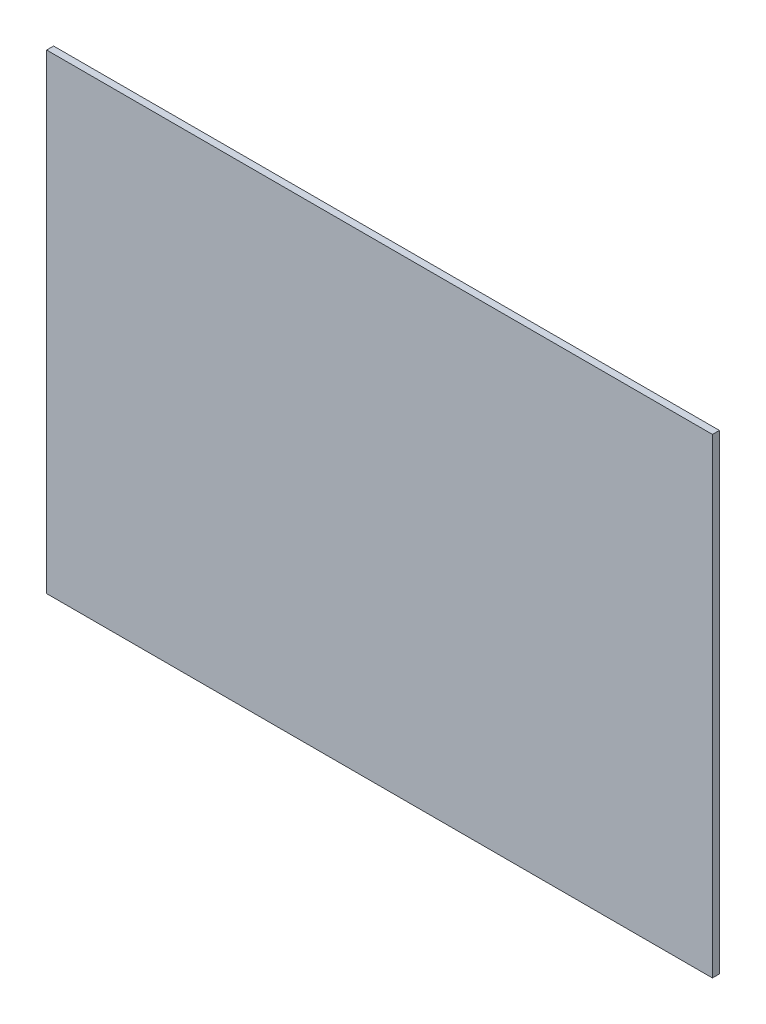
ISO-10303-21;
HEADER;
FILE_DESCRIPTION(('STEP AP214'),'2;1');
FILE_NAME('part.step','',(''),(''),'','','');
FILE_SCHEMA(('AUTOMOTIVE_DESIGN { 1 0 10303 214 1 1 1 1 }'));
ENDSEC;
DATA;
#1=APPLICATION_CONTEXT('core data for automotive mechanical design processes');
#2=APPLICATION_PROTOCOL_DEFINITION('international standard','automotive_design',2000,#1);
#3=PRODUCT_CONTEXT('',#1,'mechanical');
#4=PRODUCT('Part','Part','',(#3));
#5=PRODUCT_RELATED_PRODUCT_CATEGORY('part','',(#4));
#6=PRODUCT_DEFINITION_FORMATION('','',#4);
#7=PRODUCT_DEFINITION_CONTEXT('part definition',#1,'design');
#8=PRODUCT_DEFINITION('design','',#6,#7);
#9=PRODUCT_DEFINITION_SHAPE('','',#8);
#10=(LENGTH_UNIT() NAMED_UNIT(*) SI_UNIT(.MILLI.,.METRE.));
#11=(NAMED_UNIT(*) PLANE_ANGLE_UNIT() SI_UNIT($,.RADIAN.));
#12=(NAMED_UNIT(*) SI_UNIT($,.STERADIAN.) SOLID_ANGLE_UNIT());
#13=UNCERTAINTY_MEASURE_WITH_UNIT(LENGTH_MEASURE(1.E-05),#10,'distance_accuracy_value','');
#14=(GEOMETRIC_REPRESENTATION_CONTEXT(3) GLOBAL_UNCERTAINTY_ASSIGNED_CONTEXT((#13)) GLOBAL_UNIT_ASSIGNED_CONTEXT((#10,
#11,#12)) REPRESENTATION_CONTEXT('',''));
#15=CARTESIAN_POINT('',(0.,0.,0.));
#16=DIRECTION('',(0.,0.,1.));
#17=DIRECTION('',(1.,0.,0.));
#18=AXIS2_PLACEMENT_3D('',#15,#16,#17);
#19=CARTESIAN_POINT('',(148.5,-105.,3.1));
#20=DIRECTION('',(-1.,0.,0.));
#21=DIRECTION('',(0.,0.,1.));
#22=AXIS2_PLACEMENT_3D('',#19,#20,#21);
#23=PLANE('',#22);
#24=DIRECTION('',(0.,1.,0.));
#25=VECTOR('',#24,1.);
#26=CARTESIAN_POINT('',(148.5,-105.,0.));
#27=LINE('',#26,#25);
#28=CARTESIAN_POINT('',(148.5,-105.,0.));
#29=VERTEX_POINT('',#28);
#30=CARTESIAN_POINT('',(148.5,105.,0.));
#31=VERTEX_POINT('',#30);
#32=EDGE_CURVE('E97',#29,#31,#27,.T.);
#33=ORIENTED_EDGE('',*,*,#32,.T.);
#34=DIRECTION('',(0.,0.,-1.));
#35=VECTOR('',#34,1.);
#36=CARTESIAN_POINT('',(148.5,105.,3.1));
#37=LINE('',#36,#35);
#38=CARTESIAN_POINT('',(148.5,105.,3.1));
#39=VERTEX_POINT('',#38);
#40=EDGE_CURVE('E11',#39,#31,#37,.T.);
#41=ORIENTED_EDGE('',*,*,#40,.F.);
#42=DIRECTION('',(0.,1.,0.));
#43=VECTOR('',#42,1.);
#44=CARTESIAN_POINT('',(148.5,-105.,3.1));
#45=LINE('',#44,#43);
#46=CARTESIAN_POINT('',(148.5,-105.,3.1));
#47=VERTEX_POINT('',#46);
#48=EDGE_CURVE('E85',#47,#39,#45,.T.);
#49=ORIENTED_EDGE('',*,*,#48,.F.);
#50=DIRECTION('',(0.,0.,-1.));
#51=VECTOR('',#50,1.);
#52=CARTESIAN_POINT('',(148.5,-105.,3.1));
#53=LINE('',#52,#51);
#54=EDGE_CURVE('E93',#47,#29,#53,.T.);
#55=ORIENTED_EDGE('',*,*,#54,.T.);
#56=EDGE_LOOP('',(#33,#41,#49,#55));
#57=FACE_BOUND('',#56,.T.);
#58=ADVANCED_FACE('F34',(#57),#23,.F.);
#59=CARTESIAN_POINT('',(-148.5,105.,3.1));
#60=DIRECTION('',(0.,-1.,0.));
#61=DIRECTION('',(0.,0.,-1.));
#62=AXIS2_PLACEMENT_3D('',#59,#60,#61);
#63=PLANE('',#62);
#64=DIRECTION('',(-1.,0.,0.));
#65=VECTOR('',#64,1.);
#66=CARTESIAN_POINT('',(-148.5,105.,0.));
#67=LINE('',#66,#65);
#68=CARTESIAN_POINT('',(-148.5,105.,0.));
#69=VERTEX_POINT('',#68);
#70=EDGE_CURVE('E89',#31,#69,#67,.T.);
#71=ORIENTED_EDGE('',*,*,#70,.T.);
#72=DIRECTION('',(0.,0.,-1.));
#73=VECTOR('',#72,1.);
#74=CARTESIAN_POINT('',(-148.5,105.,3.1));
#75=LINE('',#74,#73);
#76=CARTESIAN_POINT('',(-148.5,105.,3.1));
#77=VERTEX_POINT('',#76);
#78=EDGE_CURVE('E42',#77,#69,#75,.T.);
#79=ORIENTED_EDGE('',*,*,#78,.F.);
#80=DIRECTION('',(-1.,0.,0.));
#81=VECTOR('',#80,1.);
#82=CARTESIAN_POINT('',(-148.5,105.,3.1));
#83=LINE('',#82,#81);
#84=EDGE_CURVE('E80',#39,#77,#83,.T.);
#85=ORIENTED_EDGE('',*,*,#84,.F.);
#86=ORIENTED_EDGE('',*,*,#40,.T.);
#87=EDGE_LOOP('',(#71,#79,#85,#86));
#88=FACE_BOUND('',#87,.T.);
#89=ADVANCED_FACE('F88',(#88),#63,.F.);
#90=CARTESIAN_POINT('',(-148.5,-105.,3.1));
#91=DIRECTION('',(1.,0.,0.));
#92=DIRECTION('',(0.,0.,-1.));
#93=AXIS2_PLACEMENT_3D('',#90,#91,#92);
#94=PLANE('',#93);
#95=DIRECTION('',(0.,-1.,0.));
#96=VECTOR('',#95,1.);
#97=CARTESIAN_POINT('',(-148.5,-105.,0.));
#98=LINE('',#97,#96);
#99=CARTESIAN_POINT('',(-148.5,-105.,0.));
#100=VERTEX_POINT('',#99);
#101=EDGE_CURVE('E67',#69,#100,#98,.T.);
#102=ORIENTED_EDGE('',*,*,#101,.T.);
#103=DIRECTION('',(0.,0.,-1.));
#104=VECTOR('',#103,1.);
#105=CARTESIAN_POINT('',(-148.5,-105.,3.1));
#106=LINE('',#105,#104);
#107=CARTESIAN_POINT('',(-148.5,-105.,3.1));
#108=VERTEX_POINT('',#107);
#109=EDGE_CURVE('E90',#108,#100,#106,.T.);
#110=ORIENTED_EDGE('',*,*,#109,.F.);
#111=DIRECTION('',(0.,-1.,0.));
#112=VECTOR('',#111,1.);
#113=CARTESIAN_POINT('',(-148.5,-105.,3.1));
#114=LINE('',#113,#112);
#115=EDGE_CURVE('E83',#77,#108,#114,.T.);
#116=ORIENTED_EDGE('',*,*,#115,.F.);
#117=ORIENTED_EDGE('',*,*,#78,.T.);
#118=EDGE_LOOP('',(#102,#110,#116,#117));
#119=FACE_BOUND('',#118,.T.);
#120=ADVANCED_FACE('F91',(#119),#94,.F.);
#121=CARTESIAN_POINT('',(-148.5,-105.,3.1));
#122=DIRECTION('',(0.,1.,0.));
#123=DIRECTION('',(0.,0.,1.));
#124=AXIS2_PLACEMENT_3D('',#121,#122,#123);
#125=PLANE('',#124);
#126=DIRECTION('',(1.,0.,0.));
#127=VECTOR('',#126,1.);
#128=CARTESIAN_POINT('',(-148.5,-105.,0.));
#129=LINE('',#128,#127);
#130=EDGE_CURVE('E73',#100,#29,#129,.T.);
#131=ORIENTED_EDGE('',*,*,#130,.T.);
#132=ORIENTED_EDGE('',*,*,#54,.F.);
#133=DIRECTION('',(1.,0.,0.));
#134=VECTOR('',#133,1.);
#135=CARTESIAN_POINT('',(-148.5,-105.,3.1));
#136=LINE('',#135,#134);
#137=EDGE_CURVE('E50',#108,#47,#136,.T.);
#138=ORIENTED_EDGE('',*,*,#137,.F.);
#139=ORIENTED_EDGE('',*,*,#109,.T.);
#140=EDGE_LOOP('',(#131,#132,#138,#139));
#141=FACE_BOUND('',#140,.T.);
#142=ADVANCED_FACE('F104',(#141),#125,.F.);
#143=CARTESIAN_POINT('',(0.,0.,3.1));
#144=DIRECTION('',(0.,0.,-1.));
#145=DIRECTION('',(-1.,0.,0.));
#146=AXIS2_PLACEMENT_3D('',#143,#144,#145);
#147=PLANE('',#146);
#148=ORIENTED_EDGE('',*,*,#48,.T.);
#149=ORIENTED_EDGE('',*,*,#84,.T.);
#150=ORIENTED_EDGE('',*,*,#115,.T.);
#151=ORIENTED_EDGE('',*,*,#137,.T.);
#152=EDGE_LOOP('',(#148,#149,#150,#151));
#153=FACE_BOUND('',#152,.T.);
#154=ADVANCED_FACE('F81',(#153),#147,.F.);
#155=CARTESIAN_POINT('',(0.,0.,0.));
#156=DIRECTION('',(0.,0.,-1.));
#157=DIRECTION('',(-1.,0.,0.));
#158=AXIS2_PLACEMENT_3D('',#155,#156,#157);
#159=PLANE('',#158);
#160=ORIENTED_EDGE('',*,*,#32,.F.);
#161=ORIENTED_EDGE('',*,*,#130,.F.);
#162=ORIENTED_EDGE('',*,*,#101,.F.);
#163=ORIENTED_EDGE('',*,*,#70,.F.);
#164=EDGE_LOOP('',(#160,#161,#162,#163));
#165=FACE_BOUND('',#164,.T.);
#166=ADVANCED_FACE('F107',(#165),#159,.T.);
#167=CLOSED_SHELL('',(#58,#89,#120,#142,#154,#166));
#168=MANIFOLD_SOLID_BREP('B2',#167);
#169=ADVANCED_BREP_SHAPE_REPRESENTATION('',(#18,#168),#14);
#170=SHAPE_DEFINITION_REPRESENTATION(#9,#169);
ENDSEC;
END-ISO-10303-21;
